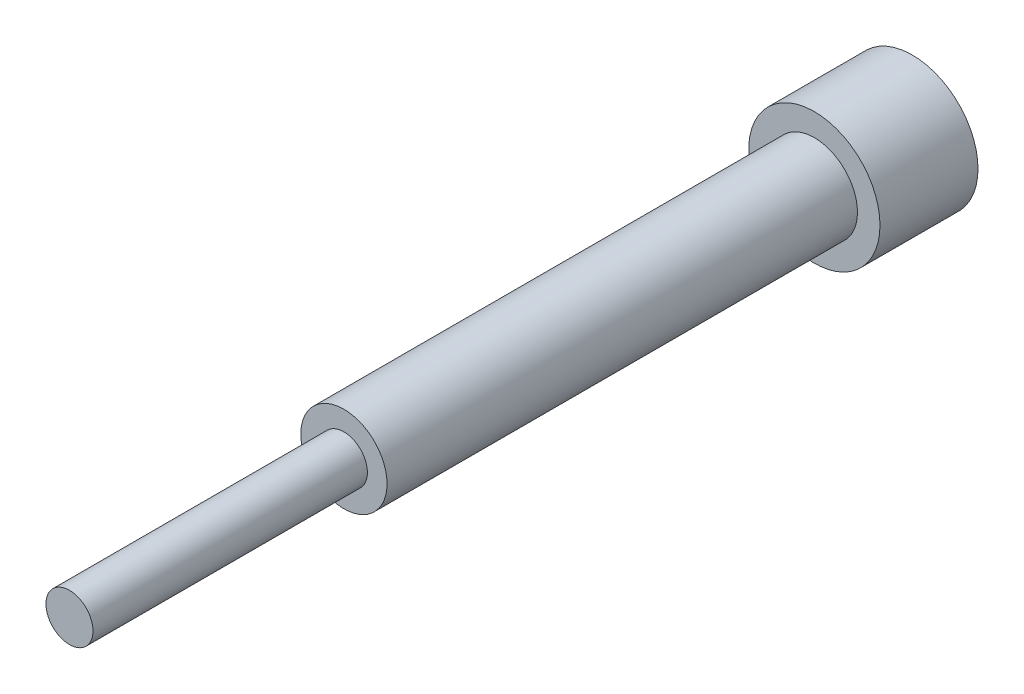
ISO-10303-21;
HEADER;
FILE_DESCRIPTION(('STEP AP214'),'2;1');
FILE_NAME('part.step','',(''),(''),'','','');
FILE_SCHEMA(('AUTOMOTIVE_DESIGN { 1 0 10303 214 1 1 1 1 }'));
ENDSEC;
DATA;
#1=APPLICATION_CONTEXT('core data for automotive mechanical design processes');
#2=APPLICATION_PROTOCOL_DEFINITION('international standard','automotive_design',2000,#1);
#3=PRODUCT_CONTEXT('',#1,'mechanical');
#4=PRODUCT('Part','Part','',(#3));
#5=PRODUCT_RELATED_PRODUCT_CATEGORY('part','',(#4));
#6=PRODUCT_DEFINITION_FORMATION('','',#4);
#7=PRODUCT_DEFINITION_CONTEXT('part definition',#1,'design');
#8=PRODUCT_DEFINITION('design','',#6,#7);
#9=PRODUCT_DEFINITION_SHAPE('','',#8);
#10=(LENGTH_UNIT() NAMED_UNIT(*) SI_UNIT(.MILLI.,.METRE.));
#11=(NAMED_UNIT(*) PLANE_ANGLE_UNIT() SI_UNIT($,.RADIAN.));
#12=(NAMED_UNIT(*) SI_UNIT($,.STERADIAN.) SOLID_ANGLE_UNIT());
#13=UNCERTAINTY_MEASURE_WITH_UNIT(LENGTH_MEASURE(1.E-05),#10,'distance_accuracy_value','');
#14=(GEOMETRIC_REPRESENTATION_CONTEXT(3) GLOBAL_UNCERTAINTY_ASSIGNED_CONTEXT((#13)) GLOBAL_UNIT_ASSIGNED_CONTEXT((#10,
#11,#12)) REPRESENTATION_CONTEXT('',''));
#15=CARTESIAN_POINT('',(0.,0.,0.));
#16=DIRECTION('',(0.,0.,1.));
#17=DIRECTION('',(1.,0.,0.));
#18=AXIS2_PLACEMENT_3D('',#15,#16,#17);
#19=CARTESIAN_POINT('',(0.,0.,145.));
#20=DIRECTION('',(0.,0.,1.));
#21=DIRECTION('',(1.,0.,0.));
#22=AXIS2_PLACEMENT_3D('',#19,#20,#21);
#23=PLANE('',#22);
#24=CARTESIAN_POINT('',(0.,0.,145.));
#25=DIRECTION('',(0.,0.,1.));
#26=DIRECTION('',(1.,0.,0.));
#27=AXIS2_PLACEMENT_3D('',#24,#25,#26);
#28=CIRCLE('',#27,11.);
#29=CARTESIAN_POINT('',(11.,0.,145.));
#30=VERTEX_POINT('',#29);
#31=EDGE_CURVE('E42',#30,#30,#28,.T.);
#32=ORIENTED_EDGE('',*,*,#31,.T.);
#33=EDGE_LOOP('',(#32));
#34=FACE_BOUND('',#33,.T.);
#35=CARTESIAN_POINT('',(0.,0.,145.));
#36=DIRECTION('',(0.,0.,1.));
#37=DIRECTION('',(1.,0.,0.));
#38=AXIS2_PLACEMENT_3D('',#35,#36,#37);
#39=CIRCLE('',#38,6.);
#40=CARTESIAN_POINT('',(6.,0.,145.));
#41=VERTEX_POINT('',#40);
#42=EDGE_CURVE('E50',#41,#41,#39,.T.);
#43=ORIENTED_EDGE('',*,*,#42,.F.);
#44=EDGE_LOOP('',(#43));
#45=FACE_BOUND('',#44,.T.);
#46=ADVANCED_FACE('F31',(#34,#45),#23,.T.);
#47=CARTESIAN_POINT('',(0.,0.,25.));
#48=DIRECTION('',(0.,0.,1.));
#49=DIRECTION('',(1.,0.,0.));
#50=AXIS2_PLACEMENT_3D('',#47,#48,#49);
#51=PLANE('',#50);
#52=CARTESIAN_POINT('',(0.,0.,25.));
#53=DIRECTION('',(0.,0.,1.));
#54=DIRECTION('',(1.,0.,0.));
#55=AXIS2_PLACEMENT_3D('',#52,#53,#54);
#56=CIRCLE('',#55,16.75);
#57=CARTESIAN_POINT('',(16.75,0.,25.));
#58=VERTEX_POINT('',#57);
#59=EDGE_CURVE('E10',#58,#58,#56,.T.);
#60=ORIENTED_EDGE('',*,*,#59,.T.);
#61=EDGE_LOOP('',(#60));
#62=FACE_BOUND('',#61,.T.);
#63=CARTESIAN_POINT('',(0.,0.,25.));
#64=DIRECTION('',(0.,0.,1.));
#65=DIRECTION('',(1.,0.,0.));
#66=AXIS2_PLACEMENT_3D('',#63,#64,#65);
#67=CIRCLE('',#66,11.);
#68=CARTESIAN_POINT('',(11.,0.,25.));
#69=VERTEX_POINT('',#68);
#70=EDGE_CURVE('E44',#69,#69,#67,.T.);
#71=ORIENTED_EDGE('',*,*,#70,.F.);
#72=EDGE_LOOP('',(#71));
#73=FACE_BOUND('',#72,.T.);
#74=ADVANCED_FACE('F66',(#62,#73),#51,.T.);
#75=CARTESIAN_POINT('',(0.,0.,25.));
#76=DIRECTION('',(0.,0.,-1.));
#77=DIRECTION('',(-1.,0.,0.));
#78=AXIS2_PLACEMENT_3D('',#75,#76,#77);
#79=CYLINDRICAL_SURFACE('',#78,16.75);
#80=ORIENTED_EDGE('',*,*,#59,.F.);
#81=EDGE_LOOP('',(#80));
#82=FACE_BOUND('',#81,.T.);
#83=CARTESIAN_POINT('',(0.,0.,0.));
#84=DIRECTION('',(0.,0.,1.));
#85=DIRECTION('',(1.,0.,0.));
#86=AXIS2_PLACEMENT_3D('',#83,#84,#85);
#87=CIRCLE('',#86,16.75);
#88=CARTESIAN_POINT('',(16.75,0.,0.));
#89=VERTEX_POINT('',#88);
#90=EDGE_CURVE('E35',#89,#89,#87,.T.);
#91=ORIENTED_EDGE('',*,*,#90,.T.);
#92=EDGE_LOOP('',(#91));
#93=FACE_BOUND('',#92,.T.);
#94=ADVANCED_FACE('F33',(#82,#93),#79,.T.);
#95=CARTESIAN_POINT('',(0.,0.,0.));
#96=DIRECTION('',(0.,0.,1.));
#97=DIRECTION('',(1.,0.,0.));
#98=AXIS2_PLACEMENT_3D('',#95,#96,#97);
#99=PLANE('',#98);
#100=ORIENTED_EDGE('',*,*,#90,.F.);
#101=EDGE_LOOP('',(#100));
#102=FACE_BOUND('',#101,.T.);
#103=ADVANCED_FACE('F76',(#102),#99,.F.);
#104=CARTESIAN_POINT('',(0.,0.,145.));
#105=DIRECTION('',(0.,0.,-1.));
#106=DIRECTION('',(-1.,0.,0.));
#107=AXIS2_PLACEMENT_3D('',#104,#105,#106);
#108=CYLINDRICAL_SURFACE('',#107,11.);
#109=ORIENTED_EDGE('',*,*,#31,.F.);
#110=EDGE_LOOP('',(#109));
#111=FACE_BOUND('',#110,.T.);
#112=ORIENTED_EDGE('',*,*,#70,.T.);
#113=EDGE_LOOP('',(#112));
#114=FACE_BOUND('',#113,.T.);
#115=ADVANCED_FACE('F61',(#111,#114),#108,.T.);
#116=CARTESIAN_POINT('',(0.,0.,215.));
#117=DIRECTION('',(0.,0.,-1.));
#118=DIRECTION('',(-1.,0.,0.));
#119=AXIS2_PLACEMENT_3D('',#116,#117,#118);
#120=CYLINDRICAL_SURFACE('',#119,6.);
#121=CARTESIAN_POINT('',(0.,0.,215.));
#122=DIRECTION('',(0.,0.,1.));
#123=DIRECTION('',(1.,0.,0.));
#124=AXIS2_PLACEMENT_3D('',#121,#122,#123);
#125=CIRCLE('',#124,6.);
#126=CARTESIAN_POINT('',(6.,0.,215.));
#127=VERTEX_POINT('',#126);
#128=EDGE_CURVE('E47',#127,#127,#125,.T.);
#129=ORIENTED_EDGE('',*,*,#128,.F.);
#130=EDGE_LOOP('',(#129));
#131=FACE_BOUND('',#130,.T.);
#132=ORIENTED_EDGE('',*,*,#42,.T.);
#133=EDGE_LOOP('',(#132));
#134=FACE_BOUND('',#133,.T.);
#135=ADVANCED_FACE('F58',(#131,#134),#120,.T.);
#136=CARTESIAN_POINT('',(0.,0.,215.));
#137=DIRECTION('',(0.,0.,1.));
#138=DIRECTION('',(1.,0.,0.));
#139=AXIS2_PLACEMENT_3D('',#136,#137,#138);
#140=PLANE('',#139);
#141=ORIENTED_EDGE('',*,*,#128,.T.);
#142=EDGE_LOOP('',(#141));
#143=FACE_BOUND('',#142,.T.);
#144=ADVANCED_FACE('F56',(#143),#140,.T.);
#145=CLOSED_SHELL('',(#46,#74,#94,#103,#115,#135,#144));
#146=MANIFOLD_SOLID_BREP('B2',#145);
#147=ADVANCED_BREP_SHAPE_REPRESENTATION('',(#18,#146),#14);
#148=SHAPE_DEFINITION_REPRESENTATION(#9,#147);
ENDSEC;
END-ISO-10303-21;
